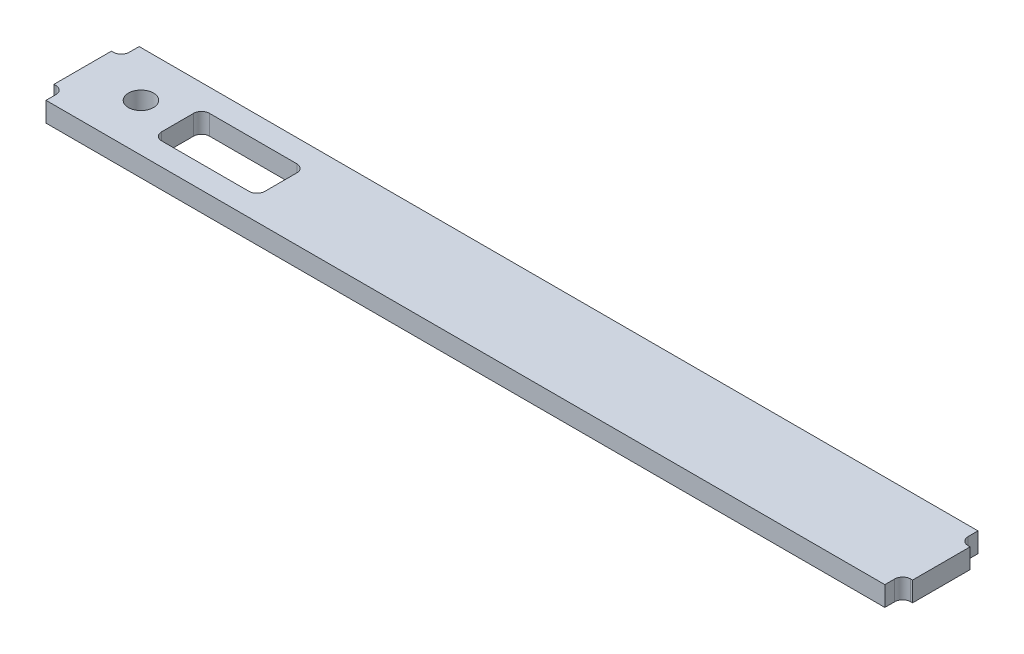
ISO-10303-21;
HEADER;
FILE_DESCRIPTION(('STEP AP214'),'2;1');
FILE_NAME('part.step','',(''),(''),'','','');
FILE_SCHEMA(('AUTOMOTIVE_DESIGN { 1 0 10303 214 1 1 1 1 }'));
ENDSEC;
DATA;
#1=APPLICATION_CONTEXT('core data for automotive mechanical design processes');
#2=APPLICATION_PROTOCOL_DEFINITION('international standard','automotive_design',2000,#1);
#3=PRODUCT_CONTEXT('',#1,'mechanical');
#4=PRODUCT('Part','Part','',(#3));
#5=PRODUCT_RELATED_PRODUCT_CATEGORY('part','',(#4));
#6=PRODUCT_DEFINITION_FORMATION('','',#4);
#7=PRODUCT_DEFINITION_CONTEXT('part definition',#1,'design');
#8=PRODUCT_DEFINITION('design','',#6,#7);
#9=PRODUCT_DEFINITION_SHAPE('','',#8);
#10=(LENGTH_UNIT() NAMED_UNIT(*) SI_UNIT(.MILLI.,.METRE.));
#11=(NAMED_UNIT(*) PLANE_ANGLE_UNIT() SI_UNIT($,.RADIAN.));
#12=(NAMED_UNIT(*) SI_UNIT($,.STERADIAN.) SOLID_ANGLE_UNIT());
#13=UNCERTAINTY_MEASURE_WITH_UNIT(LENGTH_MEASURE(1.E-05),#10,'distance_accuracy_value','');
#14=(GEOMETRIC_REPRESENTATION_CONTEXT(3) GLOBAL_UNCERTAINTY_ASSIGNED_CONTEXT((#13)) GLOBAL_UNIT_ASSIGNED_CONTEXT((#10,
#11,#12)) REPRESENTATION_CONTEXT('',''));
#15=CARTESIAN_POINT('',(0.,0.,0.));
#16=DIRECTION('',(0.,0.,1.));
#17=DIRECTION('',(1.,0.,0.));
#18=AXIS2_PLACEMENT_3D('',#15,#16,#17);
#19=CARTESIAN_POINT('',(336.55,15.875,-37.3713999840001));
#20=DIRECTION('',(-1.,0.,0.));
#21=DIRECTION('',(0.,0.,1.));
#22=AXIS2_PLACEMENT_3D('',#19,#20,#21);
#23=PLANE('',#22);
#24=DIRECTION('',(0.,0.,-1.));
#25=VECTOR('',#24,1.);
#26=CARTESIAN_POINT('',(336.55,15.875,-37.3713999840001));
#27=LINE('',#26,#25);
#28=CARTESIAN_POINT('',(336.55,15.875,-29.433899984));
#29=VERTEX_POINT('',#28);
#30=CARTESIAN_POINT('',(336.55,15.875,-37.3713999840001));
#31=VERTEX_POINT('',#30);
#32=EDGE_CURVE('E264',#29,#31,#27,.T.);
#33=ORIENTED_EDGE('',*,*,#32,.F.);
#34=DIRECTION('',(0.,1.,0.));
#35=VECTOR('',#34,1.);
#36=CARTESIAN_POINT('',(336.55,15.875,-29.433899984));
#37=LINE('',#36,#35);
#38=CARTESIAN_POINT('',(336.55,0.,-29.433899984));
#39=VERTEX_POINT('',#38);
#40=EDGE_CURVE('E299',#29,#39,#37,.F.);
#41=ORIENTED_EDGE('',*,*,#40,.T.);
#42=DIRECTION('',(0.,0.,-1.));
#43=VECTOR('',#42,1.);
#44=CARTESIAN_POINT('',(336.55,0.,-37.3713999840001));
#45=LINE('',#44,#43);
#46=CARTESIAN_POINT('',(336.55,0.,-37.3713999840001));
#47=VERTEX_POINT('',#46);
#48=EDGE_CURVE('E276',#39,#47,#45,.T.);
#49=ORIENTED_EDGE('',*,*,#48,.T.);
#50=DIRECTION('',(0.,-1.,0.));
#51=VECTOR('',#50,1.);
#52=CARTESIAN_POINT('',(336.55,15.875,-37.3713999840001));
#53=LINE('',#52,#51);
#54=EDGE_CURVE('E284',#31,#47,#53,.T.);
#55=ORIENTED_EDGE('',*,*,#54,.F.);
#56=EDGE_LOOP('',(#33,#41,#49,#55));
#57=FACE_BOUND('',#56,.T.);
#58=ADVANCED_FACE('F32',(#57),#23,.F.);
#59=CARTESIAN_POINT('',(-336.55,15.875,-37.371399984));
#60=DIRECTION('',(1.,0.,0.));
#61=DIRECTION('',(0.,0.,-1.));
#62=AXIS2_PLACEMENT_3D('',#59,#60,#61);
#63=PLANE('',#62);
#64=DIRECTION('',(0.,0.,1.));
#65=VECTOR('',#64,1.);
#66=CARTESIAN_POINT('',(-336.55,15.875,-37.371399984));
#67=LINE('',#66,#65);
#68=CARTESIAN_POINT('',(-336.55,15.875,29.433899984));
#69=VERTEX_POINT('',#68);
#70=CARTESIAN_POINT('',(-336.55,15.875,37.371399984));
#71=VERTEX_POINT('',#70);
#72=EDGE_CURVE('E262',#69,#71,#67,.T.);
#73=ORIENTED_EDGE('',*,*,#72,.F.);
#74=DIRECTION('',(0.,1.,0.));
#75=VECTOR('',#74,1.);
#76=CARTESIAN_POINT('',(-336.55,15.875,29.433899984));
#77=LINE('',#76,#75);
#78=CARTESIAN_POINT('',(-336.55,0.,29.433899984));
#79=VERTEX_POINT('',#78);
#80=EDGE_CURVE('E304',#69,#79,#77,.F.);
#81=ORIENTED_EDGE('',*,*,#80,.T.);
#82=DIRECTION('',(0.,0.,1.));
#83=VECTOR('',#82,1.);
#84=CARTESIAN_POINT('',(-336.55,0.,-37.371399984));
#85=LINE('',#84,#83);
#86=CARTESIAN_POINT('',(-336.55,0.,37.371399984));
#87=VERTEX_POINT('',#86);
#88=EDGE_CURVE('E258',#79,#87,#85,.T.);
#89=ORIENTED_EDGE('',*,*,#88,.T.);
#90=DIRECTION('',(0.,-1.,0.));
#91=VECTOR('',#90,1.);
#92=CARTESIAN_POINT('',(-336.55,15.875,37.371399984));
#93=LINE('',#92,#91);
#94=EDGE_CURVE('E290',#71,#87,#93,.T.);
#95=ORIENTED_EDGE('',*,*,#94,.F.);
#96=EDGE_LOOP('',(#73,#81,#89,#95));
#97=FACE_BOUND('',#96,.T.);
#98=ADVANCED_FACE('F417',(#97),#63,.F.);
#99=CARTESIAN_POINT('',(-336.55,0.,-37.371399984));
#100=VERTEX_POINT('',#99);
#101=CARTESIAN_POINT('',(-336.55,0.,-29.433899984));
#102=VERTEX_POINT('',#101);
#103=EDGE_CURVE('E271',#100,#102,#85,.T.);
#104=ORIENTED_EDGE('',*,*,#103,.T.);
#105=DIRECTION('',(0.,1.,0.));
#106=VECTOR('',#105,1.);
#107=CARTESIAN_POINT('',(-336.55,15.875,-29.433899984));
#108=LINE('',#107,#106);
#109=CARTESIAN_POINT('',(-336.55,15.875,-29.433899984));
#110=VERTEX_POINT('',#109);
#111=EDGE_CURVE('E306',#102,#110,#108,.T.);
#112=ORIENTED_EDGE('',*,*,#111,.T.);
#113=CARTESIAN_POINT('',(-336.55,15.875,-37.371399984));
#114=VERTEX_POINT('',#113);
#115=EDGE_CURVE('E259',#114,#110,#67,.T.);
#116=ORIENTED_EDGE('',*,*,#115,.F.);
#117=DIRECTION('',(0.,-1.,0.));
#118=VECTOR('',#117,1.);
#119=CARTESIAN_POINT('',(-336.55,15.875,-37.371399984));
#120=LINE('',#119,#118);
#121=EDGE_CURVE('E270',#114,#100,#120,.T.);
#122=ORIENTED_EDGE('',*,*,#121,.T.);
#123=EDGE_LOOP('',(#104,#112,#116,#122));
#124=FACE_BOUND('',#123,.T.);
#125=ADVANCED_FACE('F424',(#124),#63,.F.);
#126=CARTESIAN_POINT('',(336.55,15.875,37.371399984));
#127=DIRECTION('',(0.,0.,-1.));
#128=DIRECTION('',(-1.,0.,0.));
#129=AXIS2_PLACEMENT_3D('',#126,#127,#128);
#130=PLANE('',#129);
#131=DIRECTION('',(1.,0.,0.));
#132=VECTOR('',#131,1.);
#133=CARTESIAN_POINT('',(336.55,0.,37.371399984));
#134=LINE('',#133,#132);
#135=CARTESIAN_POINT('',(336.55,0.,37.371399984));
#136=VERTEX_POINT('',#135);
#137=EDGE_CURVE('E274',#87,#136,#134,.T.);
#138=ORIENTED_EDGE('',*,*,#137,.T.);
#139=DIRECTION('',(0.,-1.,0.));
#140=VECTOR('',#139,1.);
#141=CARTESIAN_POINT('',(336.55,15.875,37.371399984));
#142=LINE('',#141,#140);
#143=CARTESIAN_POINT('',(336.55,15.875,37.371399984));
#144=VERTEX_POINT('',#143);
#145=EDGE_CURVE('E287',#144,#136,#142,.T.);
#146=ORIENTED_EDGE('',*,*,#145,.F.);
#147=DIRECTION('',(1.,0.,0.));
#148=VECTOR('',#147,1.);
#149=CARTESIAN_POINT('',(336.55,15.875,37.371399984));
#150=LINE('',#149,#148);
#151=EDGE_CURVE('E261',#71,#144,#150,.T.);
#152=ORIENTED_EDGE('',*,*,#151,.F.);
#153=ORIENTED_EDGE('',*,*,#94,.T.);
#154=EDGE_LOOP('',(#138,#146,#152,#153));
#155=FACE_BOUND('',#154,.T.);
#156=ADVANCED_FACE('F432',(#155),#130,.F.);
#157=CARTESIAN_POINT('',(336.55,0.,29.433899984));
#158=VERTEX_POINT('',#157);
#159=EDGE_CURVE('E277',#136,#158,#45,.T.);
#160=ORIENTED_EDGE('',*,*,#159,.T.);
#161=DIRECTION('',(0.,1.,0.));
#162=VECTOR('',#161,1.);
#163=CARTESIAN_POINT('',(336.55,15.875,29.433899984));
#164=LINE('',#163,#162);
#165=CARTESIAN_POINT('',(336.55,15.875,29.433899984));
#166=VERTEX_POINT('',#165);
#167=EDGE_CURVE('E293',#158,#166,#164,.T.);
#168=ORIENTED_EDGE('',*,*,#167,.T.);
#169=EDGE_CURVE('E265',#144,#166,#27,.T.);
#170=ORIENTED_EDGE('',*,*,#169,.F.);
#171=ORIENTED_EDGE('',*,*,#145,.T.);
#172=EDGE_LOOP('',(#160,#168,#170,#171));
#173=FACE_BOUND('',#172,.T.);
#174=ADVANCED_FACE('F420',(#173),#23,.F.);
#175=CARTESIAN_POINT('',(336.55,15.875,-37.3713999840001));
#176=DIRECTION('',(0.,0.,1.));
#177=DIRECTION('',(1.,0.,0.));
#178=AXIS2_PLACEMENT_3D('',#175,#176,#177);
#179=PLANE('',#178);
#180=DIRECTION('',(-1.,0.,0.));
#181=VECTOR('',#180,1.);
#182=CARTESIAN_POINT('',(336.55,0.,-37.3713999840001));
#183=LINE('',#182,#181);
#184=EDGE_CURVE('E280',#47,#100,#183,.T.);
#185=ORIENTED_EDGE('',*,*,#184,.T.);
#186=ORIENTED_EDGE('',*,*,#121,.F.);
#187=DIRECTION('',(-1.,0.,0.));
#188=VECTOR('',#187,1.);
#189=CARTESIAN_POINT('',(336.55,15.875,-37.3713999840001));
#190=LINE('',#189,#188);
#191=EDGE_CURVE('E268',#31,#114,#190,.T.);
#192=ORIENTED_EDGE('',*,*,#191,.F.);
#193=ORIENTED_EDGE('',*,*,#54,.T.);
#194=EDGE_LOOP('',(#185,#186,#192,#193));
#195=FACE_BOUND('',#194,.T.);
#196=ADVANCED_FACE('F431',(#195),#179,.F.);
#197=CARTESIAN_POINT('',(0.,15.875,0.));
#198=DIRECTION('',(0.,-1.,0.));
#199=DIRECTION('',(0.,0.,-1.));
#200=AXIS2_PLACEMENT_3D('',#197,#198,#199);
#201=PLANE('',#200);
#202=DIRECTION('',(0.,0.,1.));
#203=VECTOR('',#202,1.);
#204=CARTESIAN_POINT('',(-185.4835,15.875,0.));
#205=LINE('',#204,#203);
#206=CARTESIAN_POINT('',(-185.4835,15.875,-12.827));
#207=VERTEX_POINT('',#206);
#208=CARTESIAN_POINT('',(-185.4835,15.875,12.827));
#209=VERTEX_POINT('',#208);
#210=EDGE_CURVE('E388',#207,#209,#205,.T.);
#211=ORIENTED_EDGE('',*,*,#210,.T.);
#212=CARTESIAN_POINT('',(-191.8335,15.875,12.827));
#213=DIRECTION('',(0.,-1.,0.));
#214=DIRECTION('',(0.,0.,-1.));
#215=AXIS2_PLACEMENT_3D('',#212,#213,#214);
#216=CIRCLE('',#215,6.35);
#217=CARTESIAN_POINT('',(-191.8335,15.875,19.177));
#218=VERTEX_POINT('',#217);
#219=EDGE_CURVE('E54',#209,#218,#216,.T.);
#220=ORIENTED_EDGE('',*,*,#219,.T.);
#221=DIRECTION('',(-1.,0.,0.));
#222=VECTOR('',#221,1.);
#223=CARTESIAN_POINT('',(0.,15.875,19.177));
#224=LINE('',#223,#222);
#225=CARTESIAN_POINT('',(-261.9375,15.875,19.177));
#226=VERTEX_POINT('',#225);
#227=EDGE_CURVE('E359',#218,#226,#224,.T.);
#228=ORIENTED_EDGE('',*,*,#227,.T.);
#229=CARTESIAN_POINT('',(-261.9375,15.875,12.827));
#230=DIRECTION('',(0.,-1.,0.));
#231=DIRECTION('',(0.,0.,-1.));
#232=AXIS2_PLACEMENT_3D('',#229,#230,#231);
#233=CIRCLE('',#232,6.35);
#234=CARTESIAN_POINT('',(-268.2875,15.875,12.827));
#235=VERTEX_POINT('',#234);
#236=EDGE_CURVE('E40',#226,#235,#233,.T.);
#237=ORIENTED_EDGE('',*,*,#236,.T.);
#238=DIRECTION('',(0.,0.,-1.));
#239=VECTOR('',#238,1.);
#240=CARTESIAN_POINT('',(-268.2875,15.875,0.));
#241=LINE('',#240,#239);
#242=CARTESIAN_POINT('',(-268.2875,15.875,-12.827));
#243=VERTEX_POINT('',#242);
#244=EDGE_CURVE('E214',#235,#243,#241,.T.);
#245=ORIENTED_EDGE('',*,*,#244,.T.);
#246=CARTESIAN_POINT('',(-261.9375,15.875,-12.827));
#247=DIRECTION('',(0.,-1.,0.));
#248=DIRECTION('',(0.,0.,-1.));
#249=AXIS2_PLACEMENT_3D('',#246,#247,#248);
#250=CIRCLE('',#249,6.35);
#251=CARTESIAN_POINT('',(-261.9375,15.875,-19.177));
#252=VERTEX_POINT('',#251);
#253=EDGE_CURVE('E346',#243,#252,#250,.T.);
#254=ORIENTED_EDGE('',*,*,#253,.T.);
#255=DIRECTION('',(1.,0.,0.));
#256=VECTOR('',#255,1.);
#257=CARTESIAN_POINT('',(0.,15.875,-19.1769999999999));
#258=LINE('',#257,#256);
#259=CARTESIAN_POINT('',(-191.8335,15.875,-19.177));
#260=VERTEX_POINT('',#259);
#261=EDGE_CURVE('E365',#252,#260,#258,.T.);
#262=ORIENTED_EDGE('',*,*,#261,.T.);
#263=CARTESIAN_POINT('',(-191.8335,15.875,-12.827));
#264=DIRECTION('',(0.,-1.,0.));
#265=DIRECTION('',(0.,0.,-1.));
#266=AXIS2_PLACEMENT_3D('',#263,#264,#265);
#267=CIRCLE('',#266,6.35);
#268=EDGE_CURVE('E350',#260,#207,#267,.T.);
#269=ORIENTED_EDGE('',*,*,#268,.T.);
#270=EDGE_LOOP('',(#211,#220,#228,#237,#245,#254,#262,#269));
#271=FACE_BOUND('',#270,.T.);
#272=CARTESIAN_POINT('',(-298.45,15.875,-0.728600015999961));
#273=DIRECTION('',(0.,-1.,0.));
#274=DIRECTION('',(0.,0.,-1.));
#275=AXIS2_PLACEMENT_3D('',#272,#273,#274);
#276=CIRCLE('',#275,10.1);
#277=CARTESIAN_POINT('',(-298.45,15.875,-10.8286000159999));
#278=VERTEX_POINT('',#277);
#279=EDGE_CURVE('E255',#278,#278,#276,.T.);
#280=ORIENTED_EDGE('',*,*,#279,.T.);
#281=EDGE_LOOP('',(#280));
#282=FACE_BOUND('',#281,.T.);
#283=ORIENTED_EDGE('',*,*,#115,.T.);
#284=CARTESIAN_POINT('',(-342.9,15.875,-29.433899984));
#285=DIRECTION('',(0.,-1.,0.));
#286=DIRECTION('',(0.,0.,-1.));
#287=AXIS2_PLACEMENT_3D('',#284,#285,#286);
#288=CIRCLE('',#287,6.35);
#289=CARTESIAN_POINT('',(-342.9,15.875,-23.083899984));
#290=VERTEX_POINT('',#289);
#291=EDGE_CURVE('E323',#110,#290,#288,.T.);
#292=ORIENTED_EDGE('',*,*,#291,.T.);
#293=DIRECTION('',(-1.,0.,0.));
#294=VECTOR('',#293,1.);
#295=CARTESIAN_POINT('',(-336.55,15.875,-23.083899984));
#296=LINE('',#295,#294);
#297=CARTESIAN_POINT('',(-344.4875,15.875,-23.083899984));
#298=VERTEX_POINT('',#297);
#299=EDGE_CURVE('E229',#290,#298,#296,.T.);
#300=ORIENTED_EDGE('',*,*,#299,.T.);
#301=DIRECTION('',(0.,0.,1.));
#302=VECTOR('',#301,1.);
#303=CARTESIAN_POINT('',(-344.4875,15.875,-23.083899984));
#304=LINE('',#303,#302);
#305=CARTESIAN_POINT('',(-344.4875,15.875,23.083899984));
#306=VERTEX_POINT('',#305);
#307=EDGE_CURVE('E236',#298,#306,#304,.T.);
#308=ORIENTED_EDGE('',*,*,#307,.T.);
#309=DIRECTION('',(1.,0.,0.));
#310=VECTOR('',#309,1.);
#311=CARTESIAN_POINT('',(-336.55,15.875,23.083899984));
#312=LINE('',#311,#310);
#313=CARTESIAN_POINT('',(-342.9,15.875,23.083899984));
#314=VERTEX_POINT('',#313);
#315=EDGE_CURVE('E232',#306,#314,#312,.T.);
#316=ORIENTED_EDGE('',*,*,#315,.T.);
#317=CARTESIAN_POINT('',(-342.9,15.875,29.433899984));
#318=DIRECTION('',(0.,-1.,0.));
#319=DIRECTION('',(0.,0.,-1.));
#320=AXIS2_PLACEMENT_3D('',#317,#318,#319);
#321=CIRCLE('',#320,6.35);
#322=EDGE_CURVE('E319',#314,#69,#321,.T.);
#323=ORIENTED_EDGE('',*,*,#322,.T.);
#324=ORIENTED_EDGE('',*,*,#72,.T.);
#325=ORIENTED_EDGE('',*,*,#151,.T.);
#326=ORIENTED_EDGE('',*,*,#169,.T.);
#327=CARTESIAN_POINT('',(342.9,15.875,29.433899984));
#328=DIRECTION('',(0.,-1.,0.));
#329=DIRECTION('',(0.,0.,-1.));
#330=AXIS2_PLACEMENT_3D('',#327,#328,#329);
#331=CIRCLE('',#330,6.35);
#332=CARTESIAN_POINT('',(342.9,15.875,23.083899984));
#333=VERTEX_POINT('',#332);
#334=EDGE_CURVE('E311',#166,#333,#331,.T.);
#335=ORIENTED_EDGE('',*,*,#334,.T.);
#336=DIRECTION('',(1.,0.,0.));
#337=VECTOR('',#336,1.);
#338=CARTESIAN_POINT('',(336.55,15.875,23.083899984));
#339=LINE('',#338,#337);
#340=CARTESIAN_POINT('',(344.4875,15.875,23.083899984));
#341=VERTEX_POINT('',#340);
#342=EDGE_CURVE('E213',#333,#341,#339,.T.);
#343=ORIENTED_EDGE('',*,*,#342,.T.);
#344=DIRECTION('',(0.,0.,-1.));
#345=VECTOR('',#344,1.);
#346=CARTESIAN_POINT('',(344.4875,15.875,-23.083899984));
#347=LINE('',#346,#345);
#348=CARTESIAN_POINT('',(344.4875,15.875,-23.083899984));
#349=VERTEX_POINT('',#348);
#350=EDGE_CURVE('E199',#341,#349,#347,.T.);
#351=ORIENTED_EDGE('',*,*,#350,.T.);
#352=DIRECTION('',(-1.,0.,0.));
#353=VECTOR('',#352,1.);
#354=CARTESIAN_POINT('',(336.55,15.875,-23.083899984));
#355=LINE('',#354,#353);
#356=CARTESIAN_POINT('',(342.9,15.875,-23.083899984));
#357=VERTEX_POINT('',#356);
#358=EDGE_CURVE('E208',#349,#357,#355,.T.);
#359=ORIENTED_EDGE('',*,*,#358,.T.);
#360=CARTESIAN_POINT('',(342.9,15.875,-29.433899984));
#361=DIRECTION('',(0.,-1.,0.));
#362=DIRECTION('',(0.,0.,-1.));
#363=AXIS2_PLACEMENT_3D('',#360,#361,#362);
#364=CIRCLE('',#363,6.35);
#365=EDGE_CURVE('E315',#357,#29,#364,.T.);
#366=ORIENTED_EDGE('',*,*,#365,.T.);
#367=ORIENTED_EDGE('',*,*,#32,.T.);
#368=ORIENTED_EDGE('',*,*,#191,.T.);
#369=EDGE_LOOP('',(#283,#292,#300,#308,#316,#323,#324,#325,#326,#335,#343,#351,#359,#366,#367,#368));
#370=FACE_BOUND('',#369,.T.);
#371=ADVANCED_FACE('F217',(#271,#282,#370),#201,.F.);
#372=CARTESIAN_POINT('',(0.,0.,0.));
#373=DIRECTION('',(0.,-1.,0.));
#374=DIRECTION('',(0.,0.,-1.));
#375=AXIS2_PLACEMENT_3D('',#372,#373,#374);
#376=PLANE('',#375);
#377=DIRECTION('',(-1.,0.,0.));
#378=VECTOR('',#377,1.);
#379=CARTESIAN_POINT('',(-268.2875,0.,-19.177));
#380=LINE('',#379,#378);
#381=CARTESIAN_POINT('',(-191.8335,0.,-19.177));
#382=VERTEX_POINT('',#381);
#383=CARTESIAN_POINT('',(-261.9375,0.,-19.177));
#384=VERTEX_POINT('',#383);
#385=EDGE_CURVE('E382',#382,#384,#380,.T.);
#386=ORIENTED_EDGE('',*,*,#385,.T.);
#387=CARTESIAN_POINT('',(-261.9375,0.,-12.827));
#388=DIRECTION('',(0.,-1.,0.));
#389=DIRECTION('',(0.,0.,-1.));
#390=AXIS2_PLACEMENT_3D('',#387,#388,#389);
#391=CIRCLE('',#390,6.35);
#392=CARTESIAN_POINT('',(-268.2875,0.,-12.827));
#393=VERTEX_POINT('',#392);
#394=EDGE_CURVE('E348',#384,#393,#391,.F.);
#395=ORIENTED_EDGE('',*,*,#394,.T.);
#396=DIRECTION('',(0.,0.,1.));
#397=VECTOR('',#396,1.);
#398=CARTESIAN_POINT('',(-268.2875,0.,19.177));
#399=LINE('',#398,#397);
#400=CARTESIAN_POINT('',(-268.2875,0.,12.827));
#401=VERTEX_POINT('',#400);
#402=EDGE_CURVE('E375',#393,#401,#399,.T.);
#403=ORIENTED_EDGE('',*,*,#402,.T.);
#404=CARTESIAN_POINT('',(-261.9375,0.,12.827));
#405=DIRECTION('',(0.,-1.,0.));
#406=DIRECTION('',(0.,0.,-1.));
#407=AXIS2_PLACEMENT_3D('',#404,#405,#406);
#408=CIRCLE('',#407,6.35);
#409=CARTESIAN_POINT('',(-261.9375,0.,19.177));
#410=VERTEX_POINT('',#409);
#411=EDGE_CURVE('E11',#401,#410,#408,.F.);
#412=ORIENTED_EDGE('',*,*,#411,.T.);
#413=DIRECTION('',(1.,0.,0.));
#414=VECTOR('',#413,1.);
#415=CARTESIAN_POINT('',(-268.2875,0.,19.177));
#416=LINE('',#415,#414);
#417=CARTESIAN_POINT('',(-191.8335,0.,19.177));
#418=VERTEX_POINT('',#417);
#419=EDGE_CURVE('E373',#410,#418,#416,.T.);
#420=ORIENTED_EDGE('',*,*,#419,.T.);
#421=CARTESIAN_POINT('',(-191.8335,0.,12.827));
#422=DIRECTION('',(0.,-1.,0.));
#423=DIRECTION('',(0.,0.,-1.));
#424=AXIS2_PLACEMENT_3D('',#421,#422,#423);
#425=CIRCLE('',#424,6.35);
#426=CARTESIAN_POINT('',(-185.4835,0.,12.827));
#427=VERTEX_POINT('',#426);
#428=EDGE_CURVE('E355',#418,#427,#425,.F.);
#429=ORIENTED_EDGE('',*,*,#428,.T.);
#430=DIRECTION('',(0.,0.,-1.));
#431=VECTOR('',#430,1.);
#432=CARTESIAN_POINT('',(-185.4835,0.,19.177));
#433=LINE('',#432,#431);
#434=CARTESIAN_POINT('',(-185.4835,0.,-12.827));
#435=VERTEX_POINT('',#434);
#436=EDGE_CURVE('E379',#427,#435,#433,.T.);
#437=ORIENTED_EDGE('',*,*,#436,.T.);
#438=CARTESIAN_POINT('',(-191.8335,0.,-12.827));
#439=DIRECTION('',(0.,-1.,0.));
#440=DIRECTION('',(0.,0.,-1.));
#441=AXIS2_PLACEMENT_3D('',#438,#439,#440);
#442=CIRCLE('',#441,6.35);
#443=EDGE_CURVE('E352',#435,#382,#442,.F.);
#444=ORIENTED_EDGE('',*,*,#443,.T.);
#445=EDGE_LOOP('',(#386,#395,#403,#412,#420,#429,#437,#444));
#446=FACE_BOUND('',#445,.T.);
#447=CARTESIAN_POINT('',(-298.45,0.,-0.728600015999961));
#448=DIRECTION('',(0.,1.,0.));
#449=DIRECTION('',(0.,0.,1.));
#450=AXIS2_PLACEMENT_3D('',#447,#448,#449);
#451=CIRCLE('',#450,10.1);
#452=CARTESIAN_POINT('',(-298.45,0.,9.37139998400001));
#453=VERTEX_POINT('',#452);
#454=EDGE_CURVE('E245',#453,#453,#451,.T.);
#455=ORIENTED_EDGE('',*,*,#454,.T.);
#456=EDGE_LOOP('',(#455));
#457=FACE_BOUND('',#456,.T.);
#458=ORIENTED_EDGE('',*,*,#103,.F.);
#459=ORIENTED_EDGE('',*,*,#184,.F.);
#460=ORIENTED_EDGE('',*,*,#48,.F.);
#461=CARTESIAN_POINT('',(342.9,0.,-29.433899984));
#462=DIRECTION('',(0.,-1.,0.));
#463=DIRECTION('',(0.,0.,-1.));
#464=AXIS2_PLACEMENT_3D('',#461,#462,#463);
#465=CIRCLE('',#464,6.35);
#466=CARTESIAN_POINT('',(342.9,0.,-23.083899984));
#467=VERTEX_POINT('',#466);
#468=EDGE_CURVE('E317',#39,#467,#465,.F.);
#469=ORIENTED_EDGE('',*,*,#468,.T.);
#470=DIRECTION('',(-1.,0.,0.));
#471=VECTOR('',#470,1.);
#472=CARTESIAN_POINT('',(336.55,0.,-23.083899984));
#473=LINE('',#472,#471);
#474=CARTESIAN_POINT('',(344.4875,0.,-23.083899984));
#475=VERTEX_POINT('',#474);
#476=EDGE_CURVE('E204',#475,#467,#473,.T.);
#477=ORIENTED_EDGE('',*,*,#476,.F.);
#478=DIRECTION('',(0.,0.,-1.));
#479=VECTOR('',#478,1.);
#480=CARTESIAN_POINT('',(344.4875,0.,-23.083899984));
#481=LINE('',#480,#479);
#482=CARTESIAN_POINT('',(344.4875,0.,23.083899984));
#483=VERTEX_POINT('',#482);
#484=EDGE_CURVE('E201',#483,#475,#481,.T.);
#485=ORIENTED_EDGE('',*,*,#484,.F.);
#486=DIRECTION('',(1.,0.,0.));
#487=VECTOR('',#486,1.);
#488=CARTESIAN_POINT('',(336.55,0.,23.083899984));
#489=LINE('',#488,#487);
#490=CARTESIAN_POINT('',(342.9,0.,23.083899984));
#491=VERTEX_POINT('',#490);
#492=EDGE_CURVE('E220',#491,#483,#489,.T.);
#493=ORIENTED_EDGE('',*,*,#492,.F.);
#494=CARTESIAN_POINT('',(342.9,0.,29.433899984));
#495=DIRECTION('',(0.,-1.,0.));
#496=DIRECTION('',(0.,0.,-1.));
#497=AXIS2_PLACEMENT_3D('',#494,#495,#496);
#498=CIRCLE('',#497,6.35);
#499=EDGE_CURVE('E313',#491,#158,#498,.F.);
#500=ORIENTED_EDGE('',*,*,#499,.T.);
#501=ORIENTED_EDGE('',*,*,#159,.F.);
#502=ORIENTED_EDGE('',*,*,#137,.F.);
#503=ORIENTED_EDGE('',*,*,#88,.F.);
#504=CARTESIAN_POINT('',(-342.9,0.,29.433899984));
#505=DIRECTION('',(0.,-1.,0.));
#506=DIRECTION('',(0.,0.,-1.));
#507=AXIS2_PLACEMENT_3D('',#504,#505,#506);
#508=CIRCLE('',#507,6.35);
#509=CARTESIAN_POINT('',(-342.9,0.,23.083899984));
#510=VERTEX_POINT('',#509);
#511=EDGE_CURVE('E321',#79,#510,#508,.F.);
#512=ORIENTED_EDGE('',*,*,#511,.T.);
#513=DIRECTION('',(1.,0.,0.));
#514=VECTOR('',#513,1.);
#515=CARTESIAN_POINT('',(-336.55,0.,23.083899984));
#516=LINE('',#515,#514);
#517=CARTESIAN_POINT('',(-344.4875,0.,23.083899984));
#518=VERTEX_POINT('',#517);
#519=EDGE_CURVE('E242',#518,#510,#516,.T.);
#520=ORIENTED_EDGE('',*,*,#519,.F.);
#521=DIRECTION('',(0.,0.,1.));
#522=VECTOR('',#521,1.);
#523=CARTESIAN_POINT('',(-344.4875,0.,-23.083899984));
#524=LINE('',#523,#522);
#525=CARTESIAN_POINT('',(-344.4875,0.,-23.083899984));
#526=VERTEX_POINT('',#525);
#527=EDGE_CURVE('E247',#526,#518,#524,.T.);
#528=ORIENTED_EDGE('',*,*,#527,.F.);
#529=DIRECTION('',(-1.,0.,0.));
#530=VECTOR('',#529,1.);
#531=CARTESIAN_POINT('',(-336.55,0.,-23.083899984));
#532=LINE('',#531,#530);
#533=CARTESIAN_POINT('',(-342.9,0.,-23.083899984));
#534=VERTEX_POINT('',#533);
#535=EDGE_CURVE('E235',#534,#526,#532,.T.);
#536=ORIENTED_EDGE('',*,*,#535,.F.);
#537=CARTESIAN_POINT('',(-342.9,0.,-29.433899984));
#538=DIRECTION('',(0.,-1.,0.));
#539=DIRECTION('',(0.,0.,-1.));
#540=AXIS2_PLACEMENT_3D('',#537,#538,#539);
#541=CIRCLE('',#540,6.35);
#542=EDGE_CURVE('E325',#534,#102,#541,.F.);
#543=ORIENTED_EDGE('',*,*,#542,.T.);
#544=EDGE_LOOP('',(#458,#459,#460,#469,#477,#485,#493,#500,#501,#502,#503,#512,#520,#528,#536,#543));
#545=FACE_BOUND('',#544,.T.);
#546=ADVANCED_FACE('F371',(#446,#457,#545),#376,.T.);
#547=CARTESIAN_POINT('',(-298.45,0.,-0.728600015999961));
#548=DIRECTION('',(0.,1.,0.));
#549=DIRECTION('',(0.,0.,1.));
#550=AXIS2_PLACEMENT_3D('',#547,#548,#549);
#551=CYLINDRICAL_SURFACE('',#550,10.1);
#552=ORIENTED_EDGE('',*,*,#454,.F.);
#553=EDGE_LOOP('',(#552));
#554=FACE_BOUND('',#553,.T.);
#555=ORIENTED_EDGE('',*,*,#279,.F.);
#556=EDGE_LOOP('',(#555));
#557=FACE_BOUND('',#556,.T.);
#558=ADVANCED_FACE('F527',(#554,#557),#551,.F.);
#559=CARTESIAN_POINT('',(-336.55,-46.8451668812831,-23.083899984));
#560=DIRECTION('',(0.,0.,-1.));
#561=DIRECTION('',(-1.,0.,0.));
#562=AXIS2_PLACEMENT_3D('',#559,#560,#561);
#563=PLANE('',#562);
#564=ORIENTED_EDGE('',*,*,#299,.F.);
#565=DIRECTION('',(0.,1.,0.));
#566=VECTOR('',#565,1.);
#567=CARTESIAN_POINT('',(-342.9,-46.8451668812831,-23.083899984));
#568=LINE('',#567,#566);
#569=EDGE_CURVE('E309',#290,#534,#568,.F.);
#570=ORIENTED_EDGE('',*,*,#569,.T.);
#571=ORIENTED_EDGE('',*,*,#535,.T.);
#572=DIRECTION('',(0.,1.,0.));
#573=VECTOR('',#572,1.);
#574=CARTESIAN_POINT('',(-344.4875,-46.8451668812831,-23.083899984));
#575=LINE('',#574,#573);
#576=EDGE_CURVE('E241',#526,#298,#575,.T.);
#577=ORIENTED_EDGE('',*,*,#576,.T.);
#578=EDGE_LOOP('',(#564,#570,#571,#577));
#579=FACE_BOUND('',#578,.T.);
#580=ADVANCED_FACE('F473',(#579),#563,.T.);
#581=CARTESIAN_POINT('',(-344.4875,-46.8451668812831,-23.083899984));
#582=DIRECTION('',(-1.,0.,0.));
#583=DIRECTION('',(0.,0.,1.));
#584=AXIS2_PLACEMENT_3D('',#581,#582,#583);
#585=PLANE('',#584);
#586=ORIENTED_EDGE('',*,*,#576,.F.);
#587=ORIENTED_EDGE('',*,*,#527,.T.);
#588=DIRECTION('',(0.,1.,0.));
#589=VECTOR('',#588,1.);
#590=CARTESIAN_POINT('',(-344.4875,-46.8451668812831,23.083899984));
#591=LINE('',#590,#589);
#592=EDGE_CURVE('E246',#518,#306,#591,.T.);
#593=ORIENTED_EDGE('',*,*,#592,.T.);
#594=ORIENTED_EDGE('',*,*,#307,.F.);
#595=EDGE_LOOP('',(#586,#587,#593,#594));
#596=FACE_BOUND('',#595,.T.);
#597=ADVANCED_FACE('F479',(#596),#585,.T.);
#598=CARTESIAN_POINT('',(-336.55,-46.8451668812831,23.083899984));
#599=DIRECTION('',(0.,0.,1.));
#600=DIRECTION('',(1.,0.,0.));
#601=AXIS2_PLACEMENT_3D('',#598,#599,#600);
#602=PLANE('',#601);
#603=ORIENTED_EDGE('',*,*,#519,.T.);
#604=DIRECTION('',(0.,1.,0.));
#605=VECTOR('',#604,1.);
#606=CARTESIAN_POINT('',(-342.9,-46.8451668812831,23.083899984));
#607=LINE('',#606,#605);
#608=EDGE_CURVE('E301',#510,#314,#607,.T.);
#609=ORIENTED_EDGE('',*,*,#608,.T.);
#610=ORIENTED_EDGE('',*,*,#315,.F.);
#611=ORIENTED_EDGE('',*,*,#592,.F.);
#612=EDGE_LOOP('',(#603,#609,#610,#611));
#613=FACE_BOUND('',#612,.T.);
#614=ADVANCED_FACE('F482',(#613),#602,.T.);
#615=CARTESIAN_POINT('',(336.55,-46.8451668812831,23.083899984));
#616=DIRECTION('',(0.,0.,1.));
#617=DIRECTION('',(1.,0.,0.));
#618=AXIS2_PLACEMENT_3D('',#615,#616,#617);
#619=PLANE('',#618);
#620=ORIENTED_EDGE('',*,*,#342,.F.);
#621=DIRECTION('',(0.,1.,0.));
#622=VECTOR('',#621,1.);
#623=CARTESIAN_POINT('',(342.9,-46.8451668812831,23.083899984));
#624=LINE('',#623,#622);
#625=EDGE_CURVE('E296',#333,#491,#624,.F.);
#626=ORIENTED_EDGE('',*,*,#625,.T.);
#627=ORIENTED_EDGE('',*,*,#492,.T.);
#628=DIRECTION('',(0.,1.,0.));
#629=VECTOR('',#628,1.);
#630=CARTESIAN_POINT('',(344.4875,-46.8451668812831,23.083899984));
#631=LINE('',#630,#629);
#632=EDGE_CURVE('E222',#483,#341,#631,.T.);
#633=ORIENTED_EDGE('',*,*,#632,.T.);
#634=EDGE_LOOP('',(#620,#626,#627,#633));
#635=FACE_BOUND('',#634,.T.);
#636=ADVANCED_FACE('F451',(#635),#619,.T.);
#637=CARTESIAN_POINT('',(344.4875,-46.8451668812831,-23.083899984));
#638=DIRECTION('',(1.,0.,0.));
#639=DIRECTION('',(0.,0.,-1.));
#640=AXIS2_PLACEMENT_3D('',#637,#638,#639);
#641=PLANE('',#640);
#642=ORIENTED_EDGE('',*,*,#632,.F.);
#643=ORIENTED_EDGE('',*,*,#484,.T.);
#644=DIRECTION('',(0.,1.,0.));
#645=VECTOR('',#644,1.);
#646=CARTESIAN_POINT('',(344.4875,-46.8451668812831,-23.083899984));
#647=LINE('',#646,#645);
#648=EDGE_CURVE('E194',#475,#349,#647,.T.);
#649=ORIENTED_EDGE('',*,*,#648,.T.);
#650=ORIENTED_EDGE('',*,*,#350,.F.);
#651=EDGE_LOOP('',(#642,#643,#649,#650));
#652=FACE_BOUND('',#651,.T.);
#653=ADVANCED_FACE('F197',(#652),#641,.T.);
#654=CARTESIAN_POINT('',(336.55,-46.8451668812831,-23.083899984));
#655=DIRECTION('',(0.,0.,-1.));
#656=DIRECTION('',(-1.,0.,0.));
#657=AXIS2_PLACEMENT_3D('',#654,#655,#656);
#658=PLANE('',#657);
#659=ORIENTED_EDGE('',*,*,#476,.T.);
#660=DIRECTION('',(0.,1.,0.));
#661=VECTOR('',#660,1.);
#662=CARTESIAN_POINT('',(342.9,-46.8451668812831,-23.083899984));
#663=LINE('',#662,#661);
#664=EDGE_CURVE('E211',#467,#357,#663,.T.);
#665=ORIENTED_EDGE('',*,*,#664,.T.);
#666=ORIENTED_EDGE('',*,*,#358,.F.);
#667=ORIENTED_EDGE('',*,*,#648,.F.);
#668=EDGE_LOOP('',(#659,#665,#666,#667));
#669=FACE_BOUND('',#668,.T.);
#670=ADVANCED_FACE('F209',(#669),#658,.T.);
#671=CARTESIAN_POINT('',(342.9,15.875,29.433899984));
#672=DIRECTION('',(0.,1.,0.));
#673=DIRECTION('',(0.,0.,1.));
#674=AXIS2_PLACEMENT_3D('',#671,#672,#673);
#675=CYLINDRICAL_SURFACE('',#674,6.35);
#676=ORIENTED_EDGE('',*,*,#499,.F.);
#677=ORIENTED_EDGE('',*,*,#625,.F.);
#678=ORIENTED_EDGE('',*,*,#334,.F.);
#679=ORIENTED_EDGE('',*,*,#167,.F.);
#680=EDGE_LOOP('',(#676,#677,#678,#679));
#681=FACE_BOUND('',#680,.T.);
#682=ADVANCED_FACE('F448',(#681),#675,.F.);
#683=CARTESIAN_POINT('',(342.9,-46.8451668812831,-29.433899984));
#684=DIRECTION('',(0.,1.,0.));
#685=DIRECTION('',(0.,0.,1.));
#686=AXIS2_PLACEMENT_3D('',#683,#684,#685);
#687=CYLINDRICAL_SURFACE('',#686,6.35);
#688=ORIENTED_EDGE('',*,*,#468,.F.);
#689=ORIENTED_EDGE('',*,*,#40,.F.);
#690=ORIENTED_EDGE('',*,*,#365,.F.);
#691=ORIENTED_EDGE('',*,*,#664,.F.);
#692=EDGE_LOOP('',(#688,#689,#690,#691));
#693=FACE_BOUND('',#692,.T.);
#694=ADVANCED_FACE('F457',(#693),#687,.F.);
#695=CARTESIAN_POINT('',(-342.9,-46.8451668812831,29.433899984));
#696=DIRECTION('',(0.,1.,0.));
#697=DIRECTION('',(0.,0.,1.));
#698=AXIS2_PLACEMENT_3D('',#695,#696,#697);
#699=CYLINDRICAL_SURFACE('',#698,6.35);
#700=ORIENTED_EDGE('',*,*,#511,.F.);
#701=ORIENTED_EDGE('',*,*,#80,.F.);
#702=ORIENTED_EDGE('',*,*,#322,.F.);
#703=ORIENTED_EDGE('',*,*,#608,.F.);
#704=EDGE_LOOP('',(#700,#701,#702,#703));
#705=FACE_BOUND('',#704,.T.);
#706=ADVANCED_FACE('F486',(#705),#699,.F.);
#707=CARTESIAN_POINT('',(-342.9,15.875,-29.433899984));
#708=DIRECTION('',(0.,1.,0.));
#709=DIRECTION('',(0.,0.,1.));
#710=AXIS2_PLACEMENT_3D('',#707,#708,#709);
#711=CYLINDRICAL_SURFACE('',#710,6.35);
#712=ORIENTED_EDGE('',*,*,#542,.F.);
#713=ORIENTED_EDGE('',*,*,#569,.F.);
#714=ORIENTED_EDGE('',*,*,#291,.F.);
#715=ORIENTED_EDGE('',*,*,#111,.F.);
#716=EDGE_LOOP('',(#712,#713,#714,#715));
#717=FACE_BOUND('',#716,.T.);
#718=ADVANCED_FACE('F469',(#717),#711,.F.);
#719=CARTESIAN_POINT('',(-268.2875,0.,19.177));
#720=DIRECTION('',(-1.,0.,0.));
#721=DIRECTION('',(0.,0.,1.));
#722=AXIS2_PLACEMENT_3D('',#719,#720,#721);
#723=PLANE('',#722);
#724=ORIENTED_EDGE('',*,*,#402,.F.);
#725=DIRECTION('',(0.,1.,0.));
#726=VECTOR('',#725,1.);
#727=CARTESIAN_POINT('',(-268.2875,15.875,-12.827));
#728=LINE('',#727,#726);
#729=EDGE_CURVE('E329',#393,#243,#728,.T.);
#730=ORIENTED_EDGE('',*,*,#729,.T.);
#731=ORIENTED_EDGE('',*,*,#244,.F.);
#732=DIRECTION('',(0.,1.,0.));
#733=VECTOR('',#732,1.);
#734=CARTESIAN_POINT('',(-268.2875,0.,12.827));
#735=LINE('',#734,#733);
#736=EDGE_CURVE('E327',#235,#401,#735,.F.);
#737=ORIENTED_EDGE('',*,*,#736,.T.);
#738=EDGE_LOOP('',(#724,#730,#731,#737));
#739=FACE_BOUND('',#738,.T.);
#740=ADVANCED_FACE('F362',(#739),#723,.F.);
#741=CARTESIAN_POINT('',(-268.2875,0.,-19.177));
#742=DIRECTION('',(0.,0.,-1.));
#743=DIRECTION('',(-1.,0.,0.));
#744=AXIS2_PLACEMENT_3D('',#741,#742,#743);
#745=PLANE('',#744);
#746=ORIENTED_EDGE('',*,*,#261,.F.);
#747=DIRECTION('',(0.,1.,0.));
#748=VECTOR('',#747,1.);
#749=CARTESIAN_POINT('',(-261.9375,0.,-19.177));
#750=LINE('',#749,#748);
#751=EDGE_CURVE('E335',#252,#384,#750,.F.);
#752=ORIENTED_EDGE('',*,*,#751,.T.);
#753=ORIENTED_EDGE('',*,*,#385,.F.);
#754=DIRECTION('',(0.,1.,0.));
#755=VECTOR('',#754,1.);
#756=CARTESIAN_POINT('',(-191.8335,15.875,-19.177));
#757=LINE('',#756,#755);
#758=EDGE_CURVE('E332',#382,#260,#757,.T.);
#759=ORIENTED_EDGE('',*,*,#758,.T.);
#760=EDGE_LOOP('',(#746,#752,#753,#759));
#761=FACE_BOUND('',#760,.T.);
#762=ADVANCED_FACE('F394',(#761),#745,.F.);
#763=CARTESIAN_POINT('',(-185.4835,0.,19.177));
#764=DIRECTION('',(1.,0.,0.));
#765=DIRECTION('',(0.,0.,-1.));
#766=AXIS2_PLACEMENT_3D('',#763,#764,#765);
#767=PLANE('',#766);
#768=ORIENTED_EDGE('',*,*,#210,.F.);
#769=DIRECTION('',(0.,1.,0.));
#770=VECTOR('',#769,1.);
#771=CARTESIAN_POINT('',(-185.4835,0.,-12.827));
#772=LINE('',#771,#770);
#773=EDGE_CURVE('E340',#207,#435,#772,.F.);
#774=ORIENTED_EDGE('',*,*,#773,.T.);
#775=ORIENTED_EDGE('',*,*,#436,.F.);
#776=DIRECTION('',(0.,1.,0.));
#777=VECTOR('',#776,1.);
#778=CARTESIAN_POINT('',(-185.4835,15.875,12.827));
#779=LINE('',#778,#777);
#780=EDGE_CURVE('E337',#427,#209,#779,.T.);
#781=ORIENTED_EDGE('',*,*,#780,.T.);
#782=EDGE_LOOP('',(#768,#774,#775,#781));
#783=FACE_BOUND('',#782,.T.);
#784=ADVANCED_FACE('F406',(#783),#767,.F.);
#785=CARTESIAN_POINT('',(-268.2875,0.,19.177));
#786=DIRECTION('',(0.,0.,1.));
#787=DIRECTION('',(1.,0.,0.));
#788=AXIS2_PLACEMENT_3D('',#785,#786,#787);
#789=PLANE('',#788);
#790=ORIENTED_EDGE('',*,*,#227,.F.);
#791=DIRECTION('',(0.,1.,0.));
#792=VECTOR('',#791,1.);
#793=CARTESIAN_POINT('',(-191.8335,0.,19.177));
#794=LINE('',#793,#792);
#795=EDGE_CURVE('E344',#218,#418,#794,.F.);
#796=ORIENTED_EDGE('',*,*,#795,.T.);
#797=ORIENTED_EDGE('',*,*,#419,.F.);
#798=DIRECTION('',(0.,1.,0.));
#799=VECTOR('',#798,1.);
#800=CARTESIAN_POINT('',(-261.9375,15.875,19.177));
#801=LINE('',#800,#799);
#802=EDGE_CURVE('E342',#410,#226,#801,.T.);
#803=ORIENTED_EDGE('',*,*,#802,.T.);
#804=EDGE_LOOP('',(#790,#796,#797,#803));
#805=FACE_BOUND('',#804,.T.);
#806=ADVANCED_FACE('F377',(#805),#789,.F.);
#807=CARTESIAN_POINT('',(-261.9375,0.,-12.827));
#808=DIRECTION('',(0.,-1.,0.));
#809=DIRECTION('',(0.,0.,-1.));
#810=AXIS2_PLACEMENT_3D('',#807,#808,#809);
#811=CYLINDRICAL_SURFACE('',#810,6.35);
#812=ORIENTED_EDGE('',*,*,#394,.F.);
#813=ORIENTED_EDGE('',*,*,#751,.F.);
#814=ORIENTED_EDGE('',*,*,#253,.F.);
#815=ORIENTED_EDGE('',*,*,#729,.F.);
#816=EDGE_LOOP('',(#812,#813,#814,#815));
#817=FACE_BOUND('',#816,.T.);
#818=ADVANCED_FACE('F399',(#817),#811,.F.);
#819=CARTESIAN_POINT('',(-191.8335,0.,-12.827));
#820=DIRECTION('',(0.,-1.,0.));
#821=DIRECTION('',(0.,0.,-1.));
#822=AXIS2_PLACEMENT_3D('',#819,#820,#821);
#823=CYLINDRICAL_SURFACE('',#822,6.35);
#824=ORIENTED_EDGE('',*,*,#443,.F.);
#825=ORIENTED_EDGE('',*,*,#773,.F.);
#826=ORIENTED_EDGE('',*,*,#268,.F.);
#827=ORIENTED_EDGE('',*,*,#758,.F.);
#828=EDGE_LOOP('',(#824,#825,#826,#827));
#829=FACE_BOUND('',#828,.T.);
#830=ADVANCED_FACE('F402',(#829),#823,.F.);
#831=CARTESIAN_POINT('',(-191.8335,0.,12.827));
#832=DIRECTION('',(0.,-1.,0.));
#833=DIRECTION('',(0.,0.,-1.));
#834=AXIS2_PLACEMENT_3D('',#831,#832,#833);
#835=CYLINDRICAL_SURFACE('',#834,6.35);
#836=ORIENTED_EDGE('',*,*,#428,.F.);
#837=ORIENTED_EDGE('',*,*,#795,.F.);
#838=ORIENTED_EDGE('',*,*,#219,.F.);
#839=ORIENTED_EDGE('',*,*,#780,.F.);
#840=EDGE_LOOP('',(#836,#837,#838,#839));
#841=FACE_BOUND('',#840,.T.);
#842=ADVANCED_FACE('F409',(#841),#835,.F.);
#843=CARTESIAN_POINT('',(-261.9375,0.,12.827));
#844=DIRECTION('',(0.,-1.,0.));
#845=DIRECTION('',(0.,0.,-1.));
#846=AXIS2_PLACEMENT_3D('',#843,#844,#845);
#847=CYLINDRICAL_SURFACE('',#846,6.35);
#848=ORIENTED_EDGE('',*,*,#411,.F.);
#849=ORIENTED_EDGE('',*,*,#736,.F.);
#850=ORIENTED_EDGE('',*,*,#236,.F.);
#851=ORIENTED_EDGE('',*,*,#802,.F.);
#852=EDGE_LOOP('',(#848,#849,#850,#851));
#853=FACE_BOUND('',#852,.T.);
#854=ADVANCED_FACE('F34',(#853),#847,.F.);
#855=CLOSED_SHELL('',(#58,#98,#125,#156,#174,#196,#371,#546,#558,#580,#597,#614,#636,#653,#670,
#682,#694,#706,#718,#740,#762,#784,#806,#818,#830,#842,#854));
#856=MANIFOLD_SOLID_BREP('B2',#855);
#857=ADVANCED_BREP_SHAPE_REPRESENTATION('',(#18,#856),#14);
#858=SHAPE_DEFINITION_REPRESENTATION(#9,#857);
ENDSEC;
END-ISO-10303-21;
